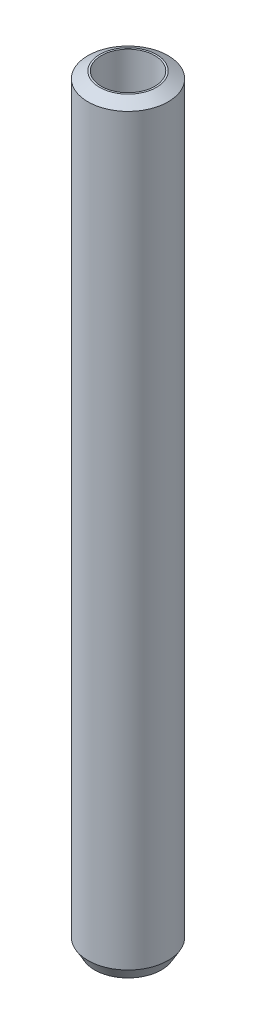
ISO-10303-21;
HEADER;
FILE_DESCRIPTION(('STEP AP214'),'2;1');
FILE_NAME('part.step','',(''),(''),'','','');
FILE_SCHEMA(('AUTOMOTIVE_DESIGN { 1 0 10303 214 1 1 1 1 }'));
ENDSEC;
DATA;
#1=APPLICATION_CONTEXT('core data for automotive mechanical design processes');
#2=APPLICATION_PROTOCOL_DEFINITION('international standard','automotive_design',2000,#1);
#3=PRODUCT_CONTEXT('',#1,'mechanical');
#4=PRODUCT('Part','Part','',(#3));
#5=PRODUCT_RELATED_PRODUCT_CATEGORY('part','',(#4));
#6=PRODUCT_DEFINITION_FORMATION('','',#4);
#7=PRODUCT_DEFINITION_CONTEXT('part definition',#1,'design');
#8=PRODUCT_DEFINITION('design','',#6,#7);
#9=PRODUCT_DEFINITION_SHAPE('','',#8);
#10=(LENGTH_UNIT() NAMED_UNIT(*) SI_UNIT(.MILLI.,.METRE.));
#11=(NAMED_UNIT(*) PLANE_ANGLE_UNIT() SI_UNIT($,.RADIAN.));
#12=(NAMED_UNIT(*) SI_UNIT($,.STERADIAN.) SOLID_ANGLE_UNIT());
#13=UNCERTAINTY_MEASURE_WITH_UNIT(LENGTH_MEASURE(1.E-05),#10,'distance_accuracy_value','');
#14=(GEOMETRIC_REPRESENTATION_CONTEXT(3) GLOBAL_UNCERTAINTY_ASSIGNED_CONTEXT((#13)) GLOBAL_UNIT_ASSIGNED_CONTEXT((#10,
#11,#12)) REPRESENTATION_CONTEXT('',''));
#15=CARTESIAN_POINT('',(0.,0.,0.));
#16=DIRECTION('',(0.,0.,1.));
#17=DIRECTION('',(1.,0.,0.));
#18=AXIS2_PLACEMENT_3D('',#15,#16,#17);
#19=CARTESIAN_POINT('',(0.,237.604769343356,0.));
#20=DIRECTION('',(0.,-1.,0.));
#21=DIRECTION('',(0.,0.,-1.));
#22=AXIS2_PLACEMENT_3D('',#19,#20,#21);
#23=CYLINDRICAL_SURFACE('',#22,12.5);
#24=CARTESIAN_POINT('',(0.,235.50996093489,0.));
#25=DIRECTION('',(0.,1.,0.));
#26=DIRECTION('',(0.,0.,1.));
#27=AXIS2_PLACEMENT_3D('',#24,#25,#26);
#28=CIRCLE('',#27,12.5);
#29=CARTESIAN_POINT('',(0.,235.50996093489,-12.5));
#30=VERTEX_POINT('',#29);
#31=EDGE_CURVE('E50',#30,#30,#28,.F.);
#32=CARTESIAN_POINT('',(0.,3.6283145955861,0.));
#33=DIRECTION('',(0.,1.,0.));
#34=DIRECTION('',(0.,0.,1.));
#35=AXIS2_PLACEMENT_3D('',#32,#33,#34);
#36=CIRCLE('',#35,12.5);
#37=CARTESIAN_POINT('',(0.,3.62831459558607,-12.5));
#38=VERTEX_POINT('',#37);
#39=EDGE_CURVE('E51',#38,#38,#36,.T.);
#40=CARTESIAN_POINT('',(0.,235.50996093489,-12.5));
#41=CARTESIAN_POINT('',(0.,233.094527118856,-12.5));
#42=CARTESIAN_POINT('',(0.,230.679093302821,-12.5));
#43=CARTESIAN_POINT('',(0.,225.848225670752,-12.5));
#44=CARTESIAN_POINT('',(0.,223.432791854718,-12.5));
#45=CARTESIAN_POINT('',(0.,218.601924222649,-12.5));
#46=CARTESIAN_POINT('',(0.,216.186490406615,-12.5));
#47=CARTESIAN_POINT('',(0.,211.355622774546,-12.5));
#48=CARTESIAN_POINT('',(0.,208.940188958512,-12.5));
#49=CARTESIAN_POINT('',(0.,204.109321326443,-12.5));
#50=CARTESIAN_POINT('',(0.,201.693887510408,-12.5));
#51=CARTESIAN_POINT('',(0.,196.863019878339,-12.5));
#52=CARTESIAN_POINT('',(0.,194.447586062305,-12.5));
#53=CARTESIAN_POINT('',(0.,189.616718430236,-12.5));
#54=CARTESIAN_POINT('',(0.,187.201284614202,-12.5));
#55=CARTESIAN_POINT('',(0.,182.370416982133,-12.5));
#56=CARTESIAN_POINT('',(0.,179.954983166099,-12.5));
#57=CARTESIAN_POINT('',(0.,175.12411553403,-12.5));
#58=CARTESIAN_POINT('',(0.,172.708681717995,-12.5));
#59=CARTESIAN_POINT('',(0.,167.877814085926,-12.5));
#60=CARTESIAN_POINT('',(0.,165.462380269892,-12.5));
#61=CARTESIAN_POINT('',(0.,160.631512637823,-12.5));
#62=CARTESIAN_POINT('',(0.,158.216078821789,-12.5));
#63=CARTESIAN_POINT('',(0.,153.38521118972,-12.5));
#64=CARTESIAN_POINT('',(0.,150.969777373686,-12.5));
#65=CARTESIAN_POINT('',(0.,146.138909741617,-12.5));
#66=CARTESIAN_POINT('',(0.,143.723475925582,-12.5));
#67=CARTESIAN_POINT('',(0.,138.892608293513,-12.5));
#68=CARTESIAN_POINT('',(0.,136.477174477479,-12.5));
#69=CARTESIAN_POINT('',(0.,131.64630684541,-12.5));
#70=CARTESIAN_POINT('',(0.,129.230873029376,-12.5));
#71=CARTESIAN_POINT('',(0.,124.400005397307,-12.5));
#72=CARTESIAN_POINT('',(0.,121.984571581273,-12.5));
#73=CARTESIAN_POINT('',(0.,117.153703949204,-12.5));
#74=CARTESIAN_POINT('',(0.,114.738270133169,-12.5));
#75=CARTESIAN_POINT('',(0.,109.9074025011,-12.5));
#76=CARTESIAN_POINT('',(0.,107.491968685066,-12.5));
#77=CARTESIAN_POINT('',(0.,102.661101052997,-12.5));
#78=CARTESIAN_POINT('',(0.,100.245667236963,-12.5));
#79=CARTESIAN_POINT('',(0.,95.4147996048939,-12.5));
#80=CARTESIAN_POINT('',(0.,92.9993657888595,-12.5));
#81=CARTESIAN_POINT('',(0.,88.1684981567907,-12.5));
#82=CARTESIAN_POINT('',(0.,85.7530643407563,-12.5));
#83=CARTESIAN_POINT('',(0.,80.9221967086874,-12.5));
#84=CARTESIAN_POINT('',(0.,78.506762892653,-12.5));
#85=CARTESIAN_POINT('',(0.,73.6758952605842,-12.5));
#86=CARTESIAN_POINT('',(0.,71.2604614445497,-12.5));
#87=CARTESIAN_POINT('',(0.,66.4295938124809,-12.5));
#88=CARTESIAN_POINT('',(0.,64.0141599964465,-12.5));
#89=CARTESIAN_POINT('',(0.,59.1832923643777,-12.5));
#90=CARTESIAN_POINT('',(0.,56.7678585483433,-12.5));
#91=CARTESIAN_POINT('',(0.,51.9369909162744,-12.5));
#92=CARTESIAN_POINT('',(0.,49.52155710024,-12.5));
#93=CARTESIAN_POINT('',(0.,44.6906894681712,-12.5));
#94=CARTESIAN_POINT('',(0.,42.2752556521367,-12.5));
#95=CARTESIAN_POINT('',(0.,37.4443880200679,-12.5));
#96=CARTESIAN_POINT('',(0.,35.0289542040335,-12.5));
#97=CARTESIAN_POINT('',(0.,30.1980865719647,-12.5));
#98=CARTESIAN_POINT('',(0.,27.7826527559302,-12.5));
#99=CARTESIAN_POINT('',(0.,22.9517851238614,-12.5));
#100=CARTESIAN_POINT('',(0.,20.536351307827,-12.5));
#101=CARTESIAN_POINT('',(0.,15.7054836757582,-12.5));
#102=CARTESIAN_POINT('',(0.,13.2900498597237,-12.5));
#103=CARTESIAN_POINT('',(0.,8.45918222765491,-12.5));
#104=CARTESIAN_POINT('',(0.,6.04374841162049,-12.5));
#105=CARTESIAN_POINT('',(0.,3.62831459558607,-12.5));
#106=B_SPLINE_CURVE_WITH_KNOTS('',3,(#40,#41,#42,#43,#44,#45,#46,#47,#48,#49,#50,#51,#52,#53,
#54,#55,#56,#57,#58,#59,#60,#61,#62,#63,#64,#65,#66,#67,#68,#69,#70,#71,#72,#73,#74,#75,#76,#77,
#78,#79,#80,#81,#82,#83,#84,#85,#86,#87,#88,#89,#90,#91,#92,#93,#94,#95,#96,#97,#98,#99,#100,
#101,#102,#103,#104,#105),.UNSPECIFIED.,.F.,.F.,(4,2,2,2,2,2,2,2,2,2,2,2,2,2,2,2,2,2,2,2,2,2,2,
2,2,2,2,2,2,2,2,2,4),(0.,7.24630144810323,14.4926028962065,21.7389043443097,28.985205792413,
36.2315072405162,43.4778086886195,50.7241101367227,57.970411584826,65.2167130329292,
72.4630144810325,79.7093159291357,86.955617377239,94.2019188253423,101.448220273446,
108.694521721549,115.940823169652,123.187124617755,130.433426065858,137.679727513962,
144.926028962065,152.172330410168,159.418631858272,166.664933306375,173.911234754478,
181.157536202581,188.403837650685,195.650139098788,202.896440546891,210.142741994994,
217.389043443098,224.635344891201,231.881646339304),.UNSPECIFIED.);
#107=EDGE_CURVE('BSEAM39',#30,#38,#106,.T.);
#108=ORIENTED_EDGE('',*,*,#31,.T.);
#109=ORIENTED_EDGE('',*,*,#39,.T.);
#110=ORIENTED_EDGE('',*,*,#107,.T.);
#111=ORIENTED_EDGE('',*,*,#107,.F.);
#112=EDGE_LOOP('',(#108,#110,#109,#111));
#113=FACE_BOUND('',#112,.T.);
#114=ADVANCED_FACE('F39',(#113),#23,.T.);
#115=CARTESIAN_POINT('',(0.,237.604769343356,0.));
#116=DIRECTION('',(0.,1.,0.));
#117=DIRECTION('',(0.,0.,1.));
#118=AXIS2_PLACEMENT_3D('',#115,#116,#117);
#119=PLANE('',#118);
#120=CARTESIAN_POINT('',(0.,237.604769343356,0.));
#121=DIRECTION('',(0.,1.,0.));
#122=DIRECTION('',(0.,0.,1.));
#123=AXIS2_PLACEMENT_3D('',#120,#121,#122);
#124=CIRCLE('',#123,8.8716854044143);
#125=CARTESIAN_POINT('',(0.,237.604769343356,8.8716854044143));
#126=VERTEX_POINT('',#125);
#127=EDGE_CURVE('E54',#126,#126,#124,.T.);
#128=ORIENTED_EDGE('',*,*,#127,.T.);
#129=EDGE_LOOP('',(#128));
#130=FACE_BOUND('',#129,.T.);
#131=CARTESIAN_POINT('',(0.,237.604769343356,0.));
#132=DIRECTION('',(0.,1.,0.));
#133=DIRECTION('',(0.,0.,1.));
#134=AXIS2_PLACEMENT_3D('',#131,#132,#133);
#135=CIRCLE('',#134,8.32947266316654);
#136=CARTESIAN_POINT('',(0.,237.604769343356,-8.32947266316654));
#137=VERTEX_POINT('',#136);
#138=EDGE_CURVE('E58',#137,#137,#135,.T.);
#139=ORIENTED_EDGE('',*,*,#138,.F.);
#140=EDGE_LOOP('',(#139));
#141=FACE_BOUND('',#140,.T.);
#142=ADVANCED_FACE('F69',(#130,#141),#119,.T.);
#143=CARTESIAN_POINT('',(0.,0.,0.));
#144=DIRECTION('',(0.,1.,0.));
#145=DIRECTION('',(0.,0.,1.));
#146=AXIS2_PLACEMENT_3D('',#143,#144,#145);
#147=PLANE('',#146);
#148=CARTESIAN_POINT('',(0.,0.,0.));
#149=DIRECTION('',(0.,1.,0.));
#150=DIRECTION('',(0.,0.,1.));
#151=AXIS2_PLACEMENT_3D('',#148,#149,#150);
#152=CIRCLE('',#151,10.4051915915337);
#153=CARTESIAN_POINT('',(0.,0.,10.4051915915337));
#154=VERTEX_POINT('',#153);
#155=EDGE_CURVE('E10',#154,#154,#152,.F.);
#156=ORIENTED_EDGE('',*,*,#155,.T.);
#157=EDGE_LOOP('',(#156));
#158=FACE_BOUND('',#157,.T.);
#159=CARTESIAN_POINT('',(0.,0.,0.));
#160=DIRECTION('',(0.,1.,0.));
#161=DIRECTION('',(0.,0.,1.));
#162=AXIS2_PLACEMENT_3D('',#159,#160,#161);
#163=CIRCLE('',#162,8.32947266316654);
#164=CARTESIAN_POINT('',(0.,0.,-8.32947266316654));
#165=VERTEX_POINT('',#164);
#166=EDGE_CURVE('E63',#165,#165,#163,.T.);
#167=ORIENTED_EDGE('',*,*,#166,.T.);
#168=EDGE_LOOP('',(#167));
#169=FACE_BOUND('',#168,.T.);
#170=ADVANCED_FACE('F75',(#158,#169),#147,.F.);
#171=CARTESIAN_POINT('',(0.,237.604769343356,0.));
#172=DIRECTION('',(0.,-1.,0.));
#173=DIRECTION('',(0.,0.,-1.));
#174=AXIS2_PLACEMENT_3D('',#171,#172,#173);
#175=CYLINDRICAL_SURFACE('',#174,8.32947266316654);
#176=CARTESIAN_POINT('',(0.,237.604769343356,-8.32947266316654));
#177=CARTESIAN_POINT('',(0.,235.129719662696,-8.32947266316654));
#178=CARTESIAN_POINT('',(0.,232.654669982036,-8.32947266316654));
#179=CARTESIAN_POINT('',(0.,227.704570620716,-8.32947266316654));
#180=CARTESIAN_POINT('',(0.,225.229520940056,-8.32947266316654));
#181=CARTESIAN_POINT('',(0.,220.279421578737,-8.32947266316654));
#182=CARTESIAN_POINT('',(0.,217.804371898077,-8.32947266316654));
#183=CARTESIAN_POINT('',(0.,212.854272536757,-8.32947266316654));
#184=CARTESIAN_POINT('',(0.,210.379222856097,-8.32947266316654));
#185=CARTESIAN_POINT('',(0.,205.429123494777,-8.32947266316654));
#186=CARTESIAN_POINT('',(0.,202.954073814117,-8.32947266316654));
#187=CARTESIAN_POINT('',(0.,198.003974452797,-8.32947266316654));
#188=CARTESIAN_POINT('',(0.,195.528924772137,-8.32947266316654));
#189=CARTESIAN_POINT('',(0.,190.578825410817,-8.32947266316654));
#190=CARTESIAN_POINT('',(0.,188.103775730157,-8.32947266316654));
#191=CARTESIAN_POINT('',(0.,183.153676368837,-8.32947266316654));
#192=CARTESIAN_POINT('',(0.,180.678626688177,-8.32947266316654));
#193=CARTESIAN_POINT('',(0.,175.728527326857,-8.32947266316654));
#194=CARTESIAN_POINT('',(0.,173.253477646197,-8.32947266316654));
#195=CARTESIAN_POINT('',(0.,168.303378284877,-8.32947266316654));
#196=CARTESIAN_POINT('',(0.,165.828328604217,-8.32947266316654));
#197=CARTESIAN_POINT('',(0.,160.878229242897,-8.32947266316654));
#198=CARTESIAN_POINT('',(0.,158.403179562237,-8.32947266316654));
#199=CARTESIAN_POINT('',(0.,153.453080200918,-8.32947266316654));
#200=CARTESIAN_POINT('',(0.,150.978030520258,-8.32947266316654));
#201=CARTESIAN_POINT('',(0.,146.027931158938,-8.32947266316654));
#202=CARTESIAN_POINT('',(0.,143.552881478278,-8.32947266316654));
#203=CARTESIAN_POINT('',(0.,138.602782116958,-8.32947266316654));
#204=CARTESIAN_POINT('',(0.,136.127732436298,-8.32947266316654));
#205=CARTESIAN_POINT('',(0.,131.177633074978,-8.32947266316654));
#206=CARTESIAN_POINT('',(0.,128.702583394318,-8.32947266316654));
#207=CARTESIAN_POINT('',(0.,123.752484032998,-8.32947266316654));
#208=CARTESIAN_POINT('',(0.,121.277434352338,-8.32947266316654));
#209=CARTESIAN_POINT('',(0.,116.327334991018,-8.32947266316654));
#210=CARTESIAN_POINT('',(0.,113.852285310358,-8.32947266316654));
#211=CARTESIAN_POINT('',(0.,108.902185949038,-8.32947266316654));
#212=CARTESIAN_POINT('',(0.,106.427136268378,-8.32947266316654));
#213=CARTESIAN_POINT('',(0.,101.477036907058,-8.32947266316654));
#214=CARTESIAN_POINT('',(0.,99.0019872263984,-8.32947266316654));
#215=CARTESIAN_POINT('',(0.,94.0518878650785,-8.32947266316654));
#216=CARTESIAN_POINT('',(0.,91.5768381844185,-8.32947266316654));
#217=CARTESIAN_POINT('',(0.,86.6267388230986,-8.32947266316654));
#218=CARTESIAN_POINT('',(0.,84.1516891424387,-8.32947266316654));
#219=CARTESIAN_POINT('',(0.,79.2015897811187,-8.32947266316654));
#220=CARTESIAN_POINT('',(0.,76.7265401004588,-8.32947266316654));
#221=CARTESIAN_POINT('',(0.,71.7764407391388,-8.32947266316654));
#222=CARTESIAN_POINT('',(0.,69.3013910584789,-8.32947266316654));
#223=CARTESIAN_POINT('',(0.,64.351291697159,-8.32947266316654));
#224=CARTESIAN_POINT('',(0.,61.876242016499,-8.32947266316654));
#225=CARTESIAN_POINT('',(0.,56.9261426551791,-8.32947266316654));
#226=CARTESIAN_POINT('',(0.,54.4510929745191,-8.32947266316654));
#227=CARTESIAN_POINT('',(0.,49.5009936131992,-8.32947266316654));
#228=CARTESIAN_POINT('',(0.,47.0259439325392,-8.32947266316654));
#229=CARTESIAN_POINT('',(0.,42.0758445712193,-8.32947266316654));
#230=CARTESIAN_POINT('',(0.,39.6007948905593,-8.32947266316654));
#231=CARTESIAN_POINT('',(0.,34.6506955292394,-8.32947266316654));
#232=CARTESIAN_POINT('',(0.,32.1756458485795,-8.32947266316654));
#233=CARTESIAN_POINT('',(0.,27.2255464872595,-8.32947266316654));
#234=CARTESIAN_POINT('',(0.,24.7504968065996,-8.32947266316654));
#235=CARTESIAN_POINT('',(0.,19.8003974452797,-8.32947266316654));
#236=CARTESIAN_POINT('',(0.,17.3253477646197,-8.32947266316654));
#237=CARTESIAN_POINT('',(0.,12.3752484032998,-8.32947266316654));
#238=CARTESIAN_POINT('',(0.,9.90019872263982,-8.32947266316654));
#239=CARTESIAN_POINT('',(0.,4.95009936131989,-8.32947266316654));
#240=CARTESIAN_POINT('',(0.,2.47504968065993,-8.32947266316654));
#241=CARTESIAN_POINT('',(0.,0.,-8.32947266316654));
#242=B_SPLINE_CURVE_WITH_KNOTS('',3,(#176,#177,#178,#179,#180,#181,#182,#183,#184,#185,#186,
#187,#188,#189,#190,#191,#192,#193,#194,#195,#196,#197,#198,#199,#200,#201,#202,#203,#204,#205,
#206,#207,#208,#209,#210,#211,#212,#213,#214,#215,#216,#217,#218,#219,#220,#221,#222,#223,#224,
#225,#226,#227,#228,#229,#230,#231,#232,#233,#234,#235,#236,#237,#238,#239,#240,#241),
.UNSPECIFIED.,.F.,.F.,(4,2,2,2,2,2,2,2,2,2,2,2,2,2,2,2,2,2,2,2,2,2,2,2,2,2,2,2,2,2,2,2,4),(0.,
7.42514904197988,14.8502980839598,22.2754471259396,29.7005961679195,37.1257452098994,
44.5508942518793,51.9760432938592,59.4011923358391,66.8263413778189,74.2514904197988,
81.6766394617787,89.1017885037586,96.5269375457385,103.952086587718,111.377235629698,
118.802384671678,126.227533713658,133.652682755638,141.077831797618,148.502980839598,
155.928129881578,163.353278923557,170.778427965537,178.203577007517,185.628726049497,
193.053875091477,200.479024133457,207.904173175437,215.329322217417,222.754471259396,
230.179620301376,237.604769343356),.UNSPECIFIED.);
#243=EDGE_CURVE('BSEAM70',#137,#165,#242,.T.);
#244=ORIENTED_EDGE('',*,*,#138,.T.);
#245=ORIENTED_EDGE('',*,*,#166,.F.);
#246=ORIENTED_EDGE('',*,*,#243,.T.);
#247=ORIENTED_EDGE('',*,*,#243,.F.);
#248=EDGE_LOOP('',(#244,#246,#245,#247));
#249=FACE_BOUND('',#248,.T.);
#250=ADVANCED_FACE('F70',(#249),#175,.F.);
#251=CARTESIAN_POINT('',(0.,237.604769343356,0.));
#252=DIRECTION('',(0.,-1.,0.));
#253=DIRECTION('',(0.,0.,-1.));
#254=AXIS2_PLACEMENT_3D('',#251,#252,#253);
#255=CONICAL_SURFACE('',#254,8.8716854044143,1.04719755119659);
#256=ORIENTED_EDGE('',*,*,#31,.F.);
#257=EDGE_LOOP('',(#256));
#258=FACE_BOUND('',#257,.T.);
#259=ORIENTED_EDGE('',*,*,#127,.F.);
#260=EDGE_LOOP('',(#259));
#261=FACE_BOUND('',#260,.T.);
#262=ADVANCED_FACE('F81',(#258,#261),#255,.T.);
#263=CARTESIAN_POINT('',(0.,3.6283145955861,0.));
#264=DIRECTION('',(0.,1.,0.));
#265=DIRECTION('',(0.,0.,1.));
#266=AXIS2_PLACEMENT_3D('',#263,#264,#265);
#267=CONICAL_SURFACE('',#266,12.5,0.523598775598302);
#268=ORIENTED_EDGE('',*,*,#155,.F.);
#269=EDGE_LOOP('',(#268));
#270=FACE_BOUND('',#269,.T.);
#271=ORIENTED_EDGE('',*,*,#39,.F.);
#272=EDGE_LOOP('',(#271));
#273=FACE_BOUND('',#272,.T.);
#274=ADVANCED_FACE('F45',(#270,#273),#267,.T.);
#275=CLOSED_SHELL('',(#114,#142,#170,#250,#262,#274));
#276=MANIFOLD_SOLID_BREP('B2',#275);
#277=ADVANCED_BREP_SHAPE_REPRESENTATION('',(#18,#276),#14);
#278=SHAPE_DEFINITION_REPRESENTATION(#9,#277);
ENDSEC;
END-ISO-10303-21;
